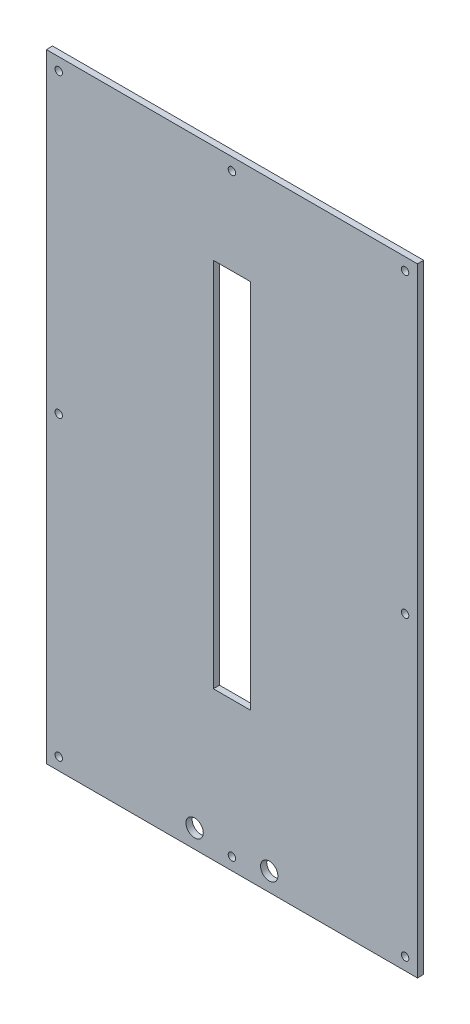
ISO-10303-21;
HEADER;
FILE_DESCRIPTION(('STEP AP214'),'2;1');
FILE_NAME('part.step','',(''),(''),'','','');
FILE_SCHEMA(('AUTOMOTIVE_DESIGN { 1 0 10303 214 1 1 1 1 }'));
ENDSEC;
DATA;
#1=APPLICATION_CONTEXT('core data for automotive mechanical design processes');
#2=APPLICATION_PROTOCOL_DEFINITION('international standard','automotive_design',2000,#1);
#3=PRODUCT_CONTEXT('',#1,'mechanical');
#4=PRODUCT('Part','Part','',(#3));
#5=PRODUCT_RELATED_PRODUCT_CATEGORY('part','',(#4));
#6=PRODUCT_DEFINITION_FORMATION('','',#4);
#7=PRODUCT_DEFINITION_CONTEXT('part definition',#1,'design');
#8=PRODUCT_DEFINITION('design','',#6,#7);
#9=PRODUCT_DEFINITION_SHAPE('','',#8);
#10=(LENGTH_UNIT() NAMED_UNIT(*) SI_UNIT(.MILLI.,.METRE.));
#11=(NAMED_UNIT(*) PLANE_ANGLE_UNIT() SI_UNIT($,.RADIAN.));
#12=(NAMED_UNIT(*) SI_UNIT($,.STERADIAN.) SOLID_ANGLE_UNIT());
#13=UNCERTAINTY_MEASURE_WITH_UNIT(LENGTH_MEASURE(1.E-05),#10,'distance_accuracy_value','');
#14=(GEOMETRIC_REPRESENTATION_CONTEXT(3) GLOBAL_UNCERTAINTY_ASSIGNED_CONTEXT((#13)) GLOBAL_UNIT_ASSIGNED_CONTEXT((#10,
#11,#12)) REPRESENTATION_CONTEXT('',''));
#15=CARTESIAN_POINT('',(0.,0.,0.));
#16=DIRECTION('',(0.,0.,1.));
#17=DIRECTION('',(1.,0.,0.));
#18=AXIS2_PLACEMENT_3D('',#15,#16,#17);
#19=CARTESIAN_POINT('',(0.,0.,5.));
#20=DIRECTION('',(0.,0.,-1.));
#21=DIRECTION('',(-1.,0.,0.));
#22=AXIS2_PLACEMENT_3D('',#19,#20,#21);
#23=PLANE('',#22);
#24=CARTESIAN_POINT('',(0.,-315.,5.));
#25=DIRECTION('',(0.,0.,1.));
#26=DIRECTION('',(1.,0.,0.));
#27=AXIS2_PLACEMENT_3D('',#24,#25,#26);
#28=CIRCLE('',#27,3.);
#29=CARTESIAN_POINT('',(3.00000000000006,-315.,5.));
#30=VERTEX_POINT('',#29);
#31=EDGE_CURVE('E138',#30,#30,#28,.T.);
#32=ORIENTED_EDGE('',*,*,#31,.F.);
#33=EDGE_LOOP('',(#32));
#34=FACE_BOUND('',#33,.T.);
#35=CARTESIAN_POINT('',(0.,165.,5.));
#36=DIRECTION('',(0.,0.,1.));
#37=DIRECTION('',(1.,0.,0.));
#38=AXIS2_PLACEMENT_3D('',#35,#36,#37);
#39=CIRCLE('',#38,3.);
#40=CARTESIAN_POINT('',(2.99999999999998,165.,5.));
#41=VERTEX_POINT('',#40);
#42=EDGE_CURVE('E144',#41,#41,#39,.T.);
#43=ORIENTED_EDGE('',*,*,#42,.F.);
#44=EDGE_LOOP('',(#43));
#45=FACE_BOUND('',#44,.T.);
#46=CARTESIAN_POINT('',(140.,165.,5.));
#47=DIRECTION('',(0.,0.,1.));
#48=DIRECTION('',(-1.,0.,0.));
#49=AXIS2_PLACEMENT_3D('',#46,#47,#48);
#50=CIRCLE('',#49,2.99999999999999);
#51=CARTESIAN_POINT('',(137.,165.,5.));
#52=VERTEX_POINT('',#51);
#53=EDGE_CURVE('E150',#52,#52,#50,.T.);
#54=ORIENTED_EDGE('',*,*,#53,.F.);
#55=EDGE_LOOP('',(#54));
#56=FACE_BOUND('',#55,.T.);
#57=CARTESIAN_POINT('',(140.,-75.,5.));
#58=DIRECTION('',(0.,0.,1.));
#59=DIRECTION('',(-1.,0.,0.));
#60=AXIS2_PLACEMENT_3D('',#57,#58,#59);
#61=CIRCLE('',#60,2.99999999999999);
#62=CARTESIAN_POINT('',(137.,-75.,5.));
#63=VERTEX_POINT('',#62);
#64=EDGE_CURVE('E156',#63,#63,#61,.T.);
#65=ORIENTED_EDGE('',*,*,#64,.F.);
#66=EDGE_LOOP('',(#65));
#67=FACE_BOUND('',#66,.T.);
#68=CARTESIAN_POINT('',(140.,-315.,5.));
#69=DIRECTION('',(0.,0.,1.));
#70=DIRECTION('',(-1.,0.,0.));
#71=AXIS2_PLACEMENT_3D('',#68,#69,#70);
#72=CIRCLE('',#71,2.99999999999999);
#73=CARTESIAN_POINT('',(137.,-315.,5.));
#74=VERTEX_POINT('',#73);
#75=EDGE_CURVE('E162',#74,#74,#72,.T.);
#76=ORIENTED_EDGE('',*,*,#75,.F.);
#77=EDGE_LOOP('',(#76));
#78=FACE_BOUND('',#77,.T.);
#79=CARTESIAN_POINT('',(-140.,-75.,5.));
#80=DIRECTION('',(0.,0.,1.));
#81=DIRECTION('',(1.,0.,0.));
#82=AXIS2_PLACEMENT_3D('',#79,#80,#81);
#83=CIRCLE('',#82,2.99999999999999);
#84=CARTESIAN_POINT('',(-137.,-75.,5.));
#85=VERTEX_POINT('',#84);
#86=EDGE_CURVE('E168',#85,#85,#83,.T.);
#87=ORIENTED_EDGE('',*,*,#86,.F.);
#88=EDGE_LOOP('',(#87));
#89=FACE_BOUND('',#88,.T.);
#90=CARTESIAN_POINT('',(-140.,-315.,5.));
#91=DIRECTION('',(0.,0.,1.));
#92=DIRECTION('',(1.,0.,0.));
#93=AXIS2_PLACEMENT_3D('',#90,#91,#92);
#94=CIRCLE('',#93,2.99999999999999);
#95=CARTESIAN_POINT('',(-137.,-315.,5.));
#96=VERTEX_POINT('',#95);
#97=EDGE_CURVE('E174',#96,#96,#94,.T.);
#98=ORIENTED_EDGE('',*,*,#97,.F.);
#99=EDGE_LOOP('',(#98));
#100=FACE_BOUND('',#99,.T.);
#101=CARTESIAN_POINT('',(-140.,165.,5.));
#102=DIRECTION('',(0.,0.,1.));
#103=DIRECTION('',(1.,0.,0.));
#104=AXIS2_PLACEMENT_3D('',#101,#102,#103);
#105=CIRCLE('',#104,2.99999999999999);
#106=CARTESIAN_POINT('',(-137.,165.,5.));
#107=VERTEX_POINT('',#106);
#108=EDGE_CURVE('E180',#107,#107,#105,.T.);
#109=ORIENTED_EDGE('',*,*,#108,.F.);
#110=EDGE_LOOP('',(#109));
#111=FACE_BOUND('',#110,.T.);
#112=DIRECTION('',(0.,1.,0.));
#113=VECTOR('',#112,1.);
#114=CARTESIAN_POINT('',(150.,-325.,5.));
#115=LINE('',#114,#113);
#116=CARTESIAN_POINT('',(150.,-325.,5.));
#117=VERTEX_POINT('',#116);
#118=CARTESIAN_POINT('',(150.,175.,5.));
#119=VERTEX_POINT('',#118);
#120=EDGE_CURVE('E186',#117,#119,#115,.T.);
#121=ORIENTED_EDGE('',*,*,#120,.T.);
#122=DIRECTION('',(-1.,0.,0.));
#123=VECTOR('',#122,1.);
#124=CARTESIAN_POINT('',(-150.,175.,5.));
#125=LINE('',#124,#123);
#126=CARTESIAN_POINT('',(-150.,175.,5.));
#127=VERTEX_POINT('',#126);
#128=EDGE_CURVE('E189',#119,#127,#125,.T.);
#129=ORIENTED_EDGE('',*,*,#128,.T.);
#130=DIRECTION('',(0.,-1.,0.));
#131=VECTOR('',#130,1.);
#132=CARTESIAN_POINT('',(-150.,-325.,5.));
#133=LINE('',#132,#131);
#134=CARTESIAN_POINT('',(-150.,-325.,5.));
#135=VERTEX_POINT('',#134);
#136=EDGE_CURVE('E192',#127,#135,#133,.T.);
#137=ORIENTED_EDGE('',*,*,#136,.T.);
#138=DIRECTION('',(1.,0.,0.));
#139=VECTOR('',#138,1.);
#140=CARTESIAN_POINT('',(-150.,-325.,5.));
#141=LINE('',#140,#139);
#142=EDGE_CURVE('E194',#135,#117,#141,.T.);
#143=ORIENTED_EDGE('',*,*,#142,.T.);
#144=EDGE_LOOP('',(#121,#129,#137,#143));
#145=FACE_BOUND('',#144,.T.);
#146=DIRECTION('',(0.,1.,0.));
#147=VECTOR('',#146,1.);
#148=CARTESIAN_POINT('',(15.,95.,5.));
#149=LINE('',#148,#147);
#150=CARTESIAN_POINT('',(15.0000000000001,-205.,5.));
#151=VERTEX_POINT('',#150);
#152=CARTESIAN_POINT('',(15.,95.,5.));
#153=VERTEX_POINT('',#152);
#154=EDGE_CURVE('E99',#151,#153,#149,.T.);
#155=ORIENTED_EDGE('',*,*,#154,.F.);
#156=DIRECTION('',(1.,0.,0.));
#157=VECTOR('',#156,1.);
#158=CARTESIAN_POINT('',(-14.9999999999999,-205.,5.));
#159=LINE('',#158,#157);
#160=CARTESIAN_POINT('',(-14.9999999999999,-205.,5.));
#161=VERTEX_POINT('',#160);
#162=EDGE_CURVE('E122',#161,#151,#159,.T.);
#163=ORIENTED_EDGE('',*,*,#162,.F.);
#164=DIRECTION('',(0.,-1.,0.));
#165=VECTOR('',#164,1.);
#166=CARTESIAN_POINT('',(-15.,95.,5.));
#167=LINE('',#166,#165);
#168=CARTESIAN_POINT('',(-15.,95.,5.));
#169=VERTEX_POINT('',#168);
#170=EDGE_CURVE('E120',#169,#161,#167,.T.);
#171=ORIENTED_EDGE('',*,*,#170,.F.);
#172=DIRECTION('',(-1.,0.,0.));
#173=VECTOR('',#172,1.);
#174=CARTESIAN_POINT('',(-15.,95.,5.));
#175=LINE('',#174,#173);
#176=EDGE_CURVE('E107',#153,#169,#175,.T.);
#177=ORIENTED_EDGE('',*,*,#176,.F.);
#178=EDGE_LOOP('',(#155,#163,#171,#177));
#179=FACE_BOUND('',#178,.T.);
#180=CARTESIAN_POINT('',(-30.1499999999999,-310.,5.));
#181=DIRECTION('',(0.,0.,1.));
#182=DIRECTION('',(1.,0.,0.));
#183=AXIS2_PLACEMENT_3D('',#180,#181,#182);
#184=CIRCLE('',#183,7.00000000000001);
#185=CARTESIAN_POINT('',(-23.1499999999999,-310.,5.));
#186=VERTEX_POINT('',#185);
#187=EDGE_CURVE('E128',#186,#186,#184,.T.);
#188=ORIENTED_EDGE('',*,*,#187,.F.);
#189=EDGE_LOOP('',(#188));
#190=FACE_BOUND('',#189,.T.);
#191=CARTESIAN_POINT('',(30.1500000000001,-310.,5.));
#192=DIRECTION('',(0.,0.,1.));
#193=DIRECTION('',(1.,0.,0.));
#194=AXIS2_PLACEMENT_3D('',#191,#192,#193);
#195=CIRCLE('',#194,7.00000000000001);
#196=CARTESIAN_POINT('',(37.1500000000001,-310.,5.));
#197=VERTEX_POINT('',#196);
#198=EDGE_CURVE('E316',#197,#197,#195,.T.);
#199=ORIENTED_EDGE('',*,*,#198,.F.);
#200=EDGE_LOOP('',(#199));
#201=FACE_BOUND('',#200,.T.);
#202=ADVANCED_FACE('F34',(#34,#45,#56,#67,#78,#89,#100,#111,#145,#179,#190,#201),#23,.F.);
#203=CARTESIAN_POINT('',(0.,0.,0.));
#204=DIRECTION('',(0.,0.,-1.));
#205=DIRECTION('',(-1.,0.,0.));
#206=AXIS2_PLACEMENT_3D('',#203,#204,#205);
#207=PLANE('',#206);
#208=CARTESIAN_POINT('',(-30.1499999999999,-310.,0.));
#209=DIRECTION('',(0.,0.,1.));
#210=DIRECTION('',(1.,0.,0.));
#211=AXIS2_PLACEMENT_3D('',#208,#209,#210);
#212=CIRCLE('',#211,7.00000000000001);
#213=CARTESIAN_POINT('',(-23.1499999999999,-310.,0.));
#214=VERTEX_POINT('',#213);
#215=EDGE_CURVE('E322',#214,#214,#212,.T.);
#216=ORIENTED_EDGE('',*,*,#215,.T.);
#217=EDGE_LOOP('',(#216));
#218=FACE_BOUND('',#217,.T.);
#219=CARTESIAN_POINT('',(0.,165.,0.));
#220=DIRECTION('',(0.,0.,1.));
#221=DIRECTION('',(1.,0.,0.));
#222=AXIS2_PLACEMENT_3D('',#219,#220,#221);
#223=CIRCLE('',#222,3.);
#224=CARTESIAN_POINT('',(2.99999999999998,165.,0.));
#225=VERTEX_POINT('',#224);
#226=EDGE_CURVE('E141',#225,#225,#223,.T.);
#227=ORIENTED_EDGE('',*,*,#226,.T.);
#228=EDGE_LOOP('',(#227));
#229=FACE_BOUND('',#228,.T.);
#230=CARTESIAN_POINT('',(140.,-75.,0.));
#231=DIRECTION('',(0.,0.,1.));
#232=DIRECTION('',(-1.,0.,0.));
#233=AXIS2_PLACEMENT_3D('',#230,#231,#232);
#234=CIRCLE('',#233,2.99999999999999);
#235=CARTESIAN_POINT('',(137.,-75.,0.));
#236=VERTEX_POINT('',#235);
#237=EDGE_CURVE('E153',#236,#236,#234,.T.);
#238=ORIENTED_EDGE('',*,*,#237,.T.);
#239=EDGE_LOOP('',(#238));
#240=FACE_BOUND('',#239,.T.);
#241=CARTESIAN_POINT('',(-140.,-75.,0.));
#242=DIRECTION('',(0.,0.,1.));
#243=DIRECTION('',(1.,0.,0.));
#244=AXIS2_PLACEMENT_3D('',#241,#242,#243);
#245=CIRCLE('',#244,2.99999999999999);
#246=CARTESIAN_POINT('',(-137.,-75.,0.));
#247=VERTEX_POINT('',#246);
#248=EDGE_CURVE('E165',#247,#247,#245,.T.);
#249=ORIENTED_EDGE('',*,*,#248,.T.);
#250=EDGE_LOOP('',(#249));
#251=FACE_BOUND('',#250,.T.);
#252=CARTESIAN_POINT('',(-140.,165.,0.));
#253=DIRECTION('',(0.,0.,1.));
#254=DIRECTION('',(1.,0.,0.));
#255=AXIS2_PLACEMENT_3D('',#252,#253,#254);
#256=CIRCLE('',#255,2.99999999999999);
#257=CARTESIAN_POINT('',(-137.,165.,0.));
#258=VERTEX_POINT('',#257);
#259=EDGE_CURVE('E177',#258,#258,#256,.T.);
#260=ORIENTED_EDGE('',*,*,#259,.T.);
#261=EDGE_LOOP('',(#260));
#262=FACE_BOUND('',#261,.T.);
#263=DIRECTION('',(0.,1.,0.));
#264=VECTOR('',#263,1.);
#265=CARTESIAN_POINT('',(150.,-325.,0.));
#266=LINE('',#265,#264);
#267=CARTESIAN_POINT('',(150.,-325.,0.));
#268=VERTEX_POINT('',#267);
#269=CARTESIAN_POINT('',(150.,175.,0.));
#270=VERTEX_POINT('',#269);
#271=EDGE_CURVE('E183',#268,#270,#266,.T.);
#272=ORIENTED_EDGE('',*,*,#271,.F.);
#273=DIRECTION('',(1.,0.,0.));
#274=VECTOR('',#273,1.);
#275=CARTESIAN_POINT('',(-150.,-325.,0.));
#276=LINE('',#275,#274);
#277=CARTESIAN_POINT('',(-150.,-325.,0.));
#278=VERTEX_POINT('',#277);
#279=EDGE_CURVE('E190',#278,#268,#276,.T.);
#280=ORIENTED_EDGE('',*,*,#279,.F.);
#281=DIRECTION('',(0.,-1.,0.));
#282=VECTOR('',#281,1.);
#283=CARTESIAN_POINT('',(-150.,-325.,0.));
#284=LINE('',#283,#282);
#285=CARTESIAN_POINT('',(-150.,175.,0.));
#286=VERTEX_POINT('',#285);
#287=EDGE_CURVE('E201',#286,#278,#284,.T.);
#288=ORIENTED_EDGE('',*,*,#287,.F.);
#289=DIRECTION('',(-1.,0.,0.));
#290=VECTOR('',#289,1.);
#291=CARTESIAN_POINT('',(-150.,175.,0.));
#292=LINE('',#291,#290);
#293=EDGE_CURVE('E199',#270,#286,#292,.T.);
#294=ORIENTED_EDGE('',*,*,#293,.F.);
#295=EDGE_LOOP('',(#272,#280,#288,#294));
#296=FACE_BOUND('',#295,.T.);
#297=CARTESIAN_POINT('',(-140.,-315.,0.));
#298=DIRECTION('',(0.,0.,1.));
#299=DIRECTION('',(1.,0.,0.));
#300=AXIS2_PLACEMENT_3D('',#297,#298,#299);
#301=CIRCLE('',#300,2.99999999999999);
#302=CARTESIAN_POINT('',(-137.,-315.,0.));
#303=VERTEX_POINT('',#302);
#304=EDGE_CURVE('E171',#303,#303,#301,.T.);
#305=ORIENTED_EDGE('',*,*,#304,.T.);
#306=EDGE_LOOP('',(#305));
#307=FACE_BOUND('',#306,.T.);
#308=CARTESIAN_POINT('',(140.,-315.,0.));
#309=DIRECTION('',(0.,0.,1.));
#310=DIRECTION('',(-1.,0.,0.));
#311=AXIS2_PLACEMENT_3D('',#308,#309,#310);
#312=CIRCLE('',#311,2.99999999999999);
#313=CARTESIAN_POINT('',(137.,-315.,0.));
#314=VERTEX_POINT('',#313);
#315=EDGE_CURVE('E159',#314,#314,#312,.T.);
#316=ORIENTED_EDGE('',*,*,#315,.T.);
#317=EDGE_LOOP('',(#316));
#318=FACE_BOUND('',#317,.T.);
#319=CARTESIAN_POINT('',(140.,165.,0.));
#320=DIRECTION('',(0.,0.,1.));
#321=DIRECTION('',(-1.,0.,0.));
#322=AXIS2_PLACEMENT_3D('',#319,#320,#321);
#323=CIRCLE('',#322,2.99999999999999);
#324=CARTESIAN_POINT('',(137.,165.,0.));
#325=VERTEX_POINT('',#324);
#326=EDGE_CURVE('E147',#325,#325,#323,.T.);
#327=ORIENTED_EDGE('',*,*,#326,.T.);
#328=EDGE_LOOP('',(#327));
#329=FACE_BOUND('',#328,.T.);
#330=CARTESIAN_POINT('',(0.,-315.,0.));
#331=DIRECTION('',(0.,0.,1.));
#332=DIRECTION('',(1.,0.,0.));
#333=AXIS2_PLACEMENT_3D('',#330,#331,#332);
#334=CIRCLE('',#333,3.);
#335=CARTESIAN_POINT('',(3.00000000000006,-315.,0.));
#336=VERTEX_POINT('',#335);
#337=EDGE_CURVE('E115',#336,#336,#334,.T.);
#338=ORIENTED_EDGE('',*,*,#337,.T.);
#339=EDGE_LOOP('',(#338));
#340=FACE_BOUND('',#339,.T.);
#341=DIRECTION('',(1.,0.,0.));
#342=VECTOR('',#341,1.);
#343=CARTESIAN_POINT('',(-14.9999999999999,-205.,0.));
#344=LINE('',#343,#342);
#345=CARTESIAN_POINT('',(-14.9999999999999,-205.,0.));
#346=VERTEX_POINT('',#345);
#347=CARTESIAN_POINT('',(15.0000000000001,-205.,0.));
#348=VERTEX_POINT('',#347);
#349=EDGE_CURVE('E108',#346,#348,#344,.T.);
#350=ORIENTED_EDGE('',*,*,#349,.T.);
#351=DIRECTION('',(0.,1.,0.));
#352=VECTOR('',#351,1.);
#353=CARTESIAN_POINT('',(15.,95.,0.));
#354=LINE('',#353,#352);
#355=CARTESIAN_POINT('',(15.,95.,0.));
#356=VERTEX_POINT('',#355);
#357=EDGE_CURVE('E57',#348,#356,#354,.T.);
#358=ORIENTED_EDGE('',*,*,#357,.T.);
#359=DIRECTION('',(-1.,0.,0.));
#360=VECTOR('',#359,1.);
#361=CARTESIAN_POINT('',(-15.,95.,0.));
#362=LINE('',#361,#360);
#363=CARTESIAN_POINT('',(-15.,95.,0.));
#364=VERTEX_POINT('',#363);
#365=EDGE_CURVE('E114',#356,#364,#362,.T.);
#366=ORIENTED_EDGE('',*,*,#365,.T.);
#367=DIRECTION('',(0.,-1.,0.));
#368=VECTOR('',#367,1.);
#369=CARTESIAN_POINT('',(-15.,95.,0.));
#370=LINE('',#369,#368);
#371=EDGE_CURVE('E130',#364,#346,#370,.T.);
#372=ORIENTED_EDGE('',*,*,#371,.T.);
#373=EDGE_LOOP('',(#350,#358,#366,#372));
#374=FACE_BOUND('',#373,.T.);
#375=CARTESIAN_POINT('',(30.1500000000001,-310.,0.));
#376=DIRECTION('',(0.,0.,1.));
#377=DIRECTION('',(1.,0.,0.));
#378=AXIS2_PLACEMENT_3D('',#375,#376,#377);
#379=CIRCLE('',#378,7.00000000000001);
#380=CARTESIAN_POINT('',(37.1500000000001,-310.,0.));
#381=VERTEX_POINT('',#380);
#382=EDGE_CURVE('E319',#381,#381,#379,.T.);
#383=ORIENTED_EDGE('',*,*,#382,.T.);
#384=EDGE_LOOP('',(#383));
#385=FACE_BOUND('',#384,.T.);
#386=ADVANCED_FACE('F219',(#218,#229,#240,#251,#262,#296,#307,#318,#329,#340,#374,#385),#207,.T.);
#387=CARTESIAN_POINT('',(150.,-325.,5.));
#388=DIRECTION('',(-1.,0.,0.));
#389=DIRECTION('',(0.,-1.,0.));
#390=AXIS2_PLACEMENT_3D('',#387,#388,#389);
#391=PLANE('',#390);
#392=ORIENTED_EDGE('',*,*,#271,.T.);
#393=DIRECTION('',(0.,0.,-1.));
#394=VECTOR('',#393,1.);
#395=CARTESIAN_POINT('',(150.,175.,5.));
#396=LINE('',#395,#394);
#397=EDGE_CURVE('E11',#119,#270,#396,.T.);
#398=ORIENTED_EDGE('',*,*,#397,.F.);
#399=ORIENTED_EDGE('',*,*,#120,.F.);
#400=DIRECTION('',(0.,0.,-1.));
#401=VECTOR('',#400,1.);
#402=CARTESIAN_POINT('',(150.,-325.,5.));
#403=LINE('',#402,#401);
#404=EDGE_CURVE('E196',#117,#268,#403,.T.);
#405=ORIENTED_EDGE('',*,*,#404,.T.);
#406=EDGE_LOOP('',(#392,#398,#399,#405));
#407=FACE_BOUND('',#406,.T.);
#408=ADVANCED_FACE('F36',(#407),#391,.F.);
#409=CARTESIAN_POINT('',(-150.,175.,5.));
#410=DIRECTION('',(0.,-1.,0.));
#411=DIRECTION('',(0.,0.,-1.));
#412=AXIS2_PLACEMENT_3D('',#409,#410,#411);
#413=PLANE('',#412);
#414=ORIENTED_EDGE('',*,*,#293,.T.);
#415=DIRECTION('',(0.,0.,-1.));
#416=VECTOR('',#415,1.);
#417=CARTESIAN_POINT('',(-150.,175.,5.));
#418=LINE('',#417,#416);
#419=EDGE_CURVE('E42',#127,#286,#418,.T.);
#420=ORIENTED_EDGE('',*,*,#419,.F.);
#421=ORIENTED_EDGE('',*,*,#128,.F.);
#422=ORIENTED_EDGE('',*,*,#397,.T.);
#423=EDGE_LOOP('',(#414,#420,#421,#422));
#424=FACE_BOUND('',#423,.T.);
#425=ADVANCED_FACE('F229',(#424),#413,.F.);
#426=CARTESIAN_POINT('',(-150.,-325.,5.));
#427=DIRECTION('',(1.,0.,0.));
#428=DIRECTION('',(0.,1.,0.));
#429=AXIS2_PLACEMENT_3D('',#426,#427,#428);
#430=PLANE('',#429);
#431=ORIENTED_EDGE('',*,*,#287,.T.);
#432=DIRECTION('',(0.,0.,-1.));
#433=VECTOR('',#432,1.);
#434=CARTESIAN_POINT('',(-150.,-325.,5.));
#435=LINE('',#434,#433);
#436=EDGE_CURVE('E206',#135,#278,#435,.T.);
#437=ORIENTED_EDGE('',*,*,#436,.F.);
#438=ORIENTED_EDGE('',*,*,#136,.F.);
#439=ORIENTED_EDGE('',*,*,#419,.T.);
#440=EDGE_LOOP('',(#431,#437,#438,#439));
#441=FACE_BOUND('',#440,.T.);
#442=ADVANCED_FACE('F213',(#441),#430,.F.);
#443=CARTESIAN_POINT('',(-150.,-325.,5.));
#444=DIRECTION('',(0.,1.,0.));
#445=DIRECTION('',(-1.,0.,0.));
#446=AXIS2_PLACEMENT_3D('',#443,#444,#445);
#447=PLANE('',#446);
#448=ORIENTED_EDGE('',*,*,#279,.T.);
#449=ORIENTED_EDGE('',*,*,#404,.F.);
#450=ORIENTED_EDGE('',*,*,#142,.F.);
#451=ORIENTED_EDGE('',*,*,#436,.T.);
#452=EDGE_LOOP('',(#448,#449,#450,#451));
#453=FACE_BOUND('',#452,.T.);
#454=ADVANCED_FACE('F223',(#453),#447,.F.);
#455=CARTESIAN_POINT('',(-140.,165.,5.));
#456=DIRECTION('',(0.,0.,-1.));
#457=DIRECTION('',(-1.,0.,0.));
#458=AXIS2_PLACEMENT_3D('',#455,#456,#457);
#459=CYLINDRICAL_SURFACE('',#458,2.99999999999999);
#460=ORIENTED_EDGE('',*,*,#108,.T.);
#461=EDGE_LOOP('',(#460));
#462=FACE_BOUND('',#461,.T.);
#463=ORIENTED_EDGE('',*,*,#259,.F.);
#464=EDGE_LOOP('',(#463));
#465=FACE_BOUND('',#464,.T.);
#466=ADVANCED_FACE('F247',(#462,#465),#459,.F.);
#467=CARTESIAN_POINT('',(-140.,-315.,5.));
#468=DIRECTION('',(0.,0.,-1.));
#469=DIRECTION('',(-1.,0.,0.));
#470=AXIS2_PLACEMENT_3D('',#467,#468,#469);
#471=CYLINDRICAL_SURFACE('',#470,2.99999999999999);
#472=ORIENTED_EDGE('',*,*,#97,.T.);
#473=EDGE_LOOP('',(#472));
#474=FACE_BOUND('',#473,.T.);
#475=ORIENTED_EDGE('',*,*,#304,.F.);
#476=EDGE_LOOP('',(#475));
#477=FACE_BOUND('',#476,.T.);
#478=ADVANCED_FACE('F254',(#474,#477),#471,.F.);
#479=CARTESIAN_POINT('',(-140.,-75.,5.));
#480=DIRECTION('',(0.,0.,-1.));
#481=DIRECTION('',(-1.,0.,0.));
#482=AXIS2_PLACEMENT_3D('',#479,#480,#481);
#483=CYLINDRICAL_SURFACE('',#482,2.99999999999999);
#484=ORIENTED_EDGE('',*,*,#86,.T.);
#485=EDGE_LOOP('',(#484));
#486=FACE_BOUND('',#485,.T.);
#487=ORIENTED_EDGE('',*,*,#248,.F.);
#488=EDGE_LOOP('',(#487));
#489=FACE_BOUND('',#488,.T.);
#490=ADVANCED_FACE('F259',(#486,#489),#483,.F.);
#491=CARTESIAN_POINT('',(140.,-315.,5.));
#492=DIRECTION('',(0.,0.,-1.));
#493=DIRECTION('',(-1.,0.,0.));
#494=AXIS2_PLACEMENT_3D('',#491,#492,#493);
#495=CYLINDRICAL_SURFACE('',#494,2.99999999999999);
#496=ORIENTED_EDGE('',*,*,#75,.T.);
#497=EDGE_LOOP('',(#496));
#498=FACE_BOUND('',#497,.T.);
#499=ORIENTED_EDGE('',*,*,#315,.F.);
#500=EDGE_LOOP('',(#499));
#501=FACE_BOUND('',#500,.T.);
#502=ADVANCED_FACE('F269',(#498,#501),#495,.F.);
#503=CARTESIAN_POINT('',(140.,-75.,5.));
#504=DIRECTION('',(0.,0.,-1.));
#505=DIRECTION('',(-1.,0.,0.));
#506=AXIS2_PLACEMENT_3D('',#503,#504,#505);
#507=CYLINDRICAL_SURFACE('',#506,2.99999999999999);
#508=ORIENTED_EDGE('',*,*,#64,.T.);
#509=EDGE_LOOP('',(#508));
#510=FACE_BOUND('',#509,.T.);
#511=ORIENTED_EDGE('',*,*,#237,.F.);
#512=EDGE_LOOP('',(#511));
#513=FACE_BOUND('',#512,.T.);
#514=ADVANCED_FACE('F276',(#510,#513),#507,.F.);
#515=CARTESIAN_POINT('',(140.,165.,5.));
#516=DIRECTION('',(0.,0.,-1.));
#517=DIRECTION('',(-1.,0.,0.));
#518=AXIS2_PLACEMENT_3D('',#515,#516,#517);
#519=CYLINDRICAL_SURFACE('',#518,2.99999999999999);
#520=ORIENTED_EDGE('',*,*,#53,.T.);
#521=EDGE_LOOP('',(#520));
#522=FACE_BOUND('',#521,.T.);
#523=ORIENTED_EDGE('',*,*,#326,.F.);
#524=EDGE_LOOP('',(#523));
#525=FACE_BOUND('',#524,.T.);
#526=ADVANCED_FACE('F280',(#522,#525),#519,.F.);
#527=CARTESIAN_POINT('',(0.,165.,5.));
#528=DIRECTION('',(0.,0.,-1.));
#529=DIRECTION('',(-1.,0.,0.));
#530=AXIS2_PLACEMENT_3D('',#527,#528,#529);
#531=CYLINDRICAL_SURFACE('',#530,3.);
#532=ORIENTED_EDGE('',*,*,#42,.T.);
#533=EDGE_LOOP('',(#532));
#534=FACE_BOUND('',#533,.T.);
#535=ORIENTED_EDGE('',*,*,#226,.F.);
#536=EDGE_LOOP('',(#535));
#537=FACE_BOUND('',#536,.T.);
#538=ADVANCED_FACE('F284',(#534,#537),#531,.F.);
#539=CARTESIAN_POINT('',(0.,-315.,5.));
#540=DIRECTION('',(0.,0.,-1.));
#541=DIRECTION('',(-1.,0.,0.));
#542=AXIS2_PLACEMENT_3D('',#539,#540,#541);
#543=CYLINDRICAL_SURFACE('',#542,3.);
#544=ORIENTED_EDGE('',*,*,#31,.T.);
#545=EDGE_LOOP('',(#544));
#546=FACE_BOUND('',#545,.T.);
#547=ORIENTED_EDGE('',*,*,#337,.F.);
#548=EDGE_LOOP('',(#547));
#549=FACE_BOUND('',#548,.T.);
#550=ADVANCED_FACE('F288',(#546,#549),#543,.F.);
#551=CARTESIAN_POINT('',(15.,95.,5.));
#552=DIRECTION('',(-1.,0.,0.));
#553=DIRECTION('',(0.,-1.,0.));
#554=AXIS2_PLACEMENT_3D('',#551,#552,#553);
#555=PLANE('',#554);
#556=ORIENTED_EDGE('',*,*,#357,.F.);
#557=DIRECTION('',(0.,0.,-1.));
#558=VECTOR('',#557,1.);
#559=CARTESIAN_POINT('',(15.0000000000001,-205.,5.));
#560=LINE('',#559,#558);
#561=EDGE_CURVE('E103',#151,#348,#560,.T.);
#562=ORIENTED_EDGE('',*,*,#561,.F.);
#563=ORIENTED_EDGE('',*,*,#154,.T.);
#564=DIRECTION('',(0.,0.,-1.));
#565=VECTOR('',#564,1.);
#566=CARTESIAN_POINT('',(15.,95.,5.));
#567=LINE('',#566,#565);
#568=EDGE_CURVE('E102',#153,#356,#567,.T.);
#569=ORIENTED_EDGE('',*,*,#568,.T.);
#570=EDGE_LOOP('',(#556,#562,#563,#569));
#571=FACE_BOUND('',#570,.T.);
#572=ADVANCED_FACE('F101',(#571),#555,.T.);
#573=CARTESIAN_POINT('',(-15.,95.,5.));
#574=DIRECTION('',(0.,-1.,0.));
#575=DIRECTION('',(0.,0.,-1.));
#576=AXIS2_PLACEMENT_3D('',#573,#574,#575);
#577=PLANE('',#576);
#578=ORIENTED_EDGE('',*,*,#365,.F.);
#579=ORIENTED_EDGE('',*,*,#568,.F.);
#580=ORIENTED_EDGE('',*,*,#176,.T.);
#581=DIRECTION('',(0.,0.,-1.));
#582=VECTOR('',#581,1.);
#583=CARTESIAN_POINT('',(-15.,95.,5.));
#584=LINE('',#583,#582);
#585=EDGE_CURVE('E116',#169,#364,#584,.T.);
#586=ORIENTED_EDGE('',*,*,#585,.T.);
#587=EDGE_LOOP('',(#578,#579,#580,#586));
#588=FACE_BOUND('',#587,.T.);
#589=ADVANCED_FACE('F111',(#588),#577,.T.);
#590=CARTESIAN_POINT('',(-15.,95.,5.));
#591=DIRECTION('',(1.,0.,0.));
#592=DIRECTION('',(0.,1.,0.));
#593=AXIS2_PLACEMENT_3D('',#590,#591,#592);
#594=PLANE('',#593);
#595=ORIENTED_EDGE('',*,*,#371,.F.);
#596=ORIENTED_EDGE('',*,*,#585,.F.);
#597=ORIENTED_EDGE('',*,*,#170,.T.);
#598=DIRECTION('',(0.,0.,-1.));
#599=VECTOR('',#598,1.);
#600=CARTESIAN_POINT('',(-14.9999999999999,-205.,5.));
#601=LINE('',#600,#599);
#602=EDGE_CURVE('E49',#161,#346,#601,.T.);
#603=ORIENTED_EDGE('',*,*,#602,.T.);
#604=EDGE_LOOP('',(#595,#596,#597,#603));
#605=FACE_BOUND('',#604,.T.);
#606=ADVANCED_FACE('F297',(#605),#594,.T.);
#607=CARTESIAN_POINT('',(-14.9999999999999,-205.,5.));
#608=DIRECTION('',(0.,1.,0.));
#609=DIRECTION('',(0.,0.,1.));
#610=AXIS2_PLACEMENT_3D('',#607,#608,#609);
#611=PLANE('',#610);
#612=ORIENTED_EDGE('',*,*,#349,.F.);
#613=ORIENTED_EDGE('',*,*,#602,.F.);
#614=ORIENTED_EDGE('',*,*,#162,.T.);
#615=ORIENTED_EDGE('',*,*,#561,.T.);
#616=EDGE_LOOP('',(#612,#613,#614,#615));
#617=FACE_BOUND('',#616,.T.);
#618=ADVANCED_FACE('F300',(#617),#611,.T.);
#619=CARTESIAN_POINT('',(-30.1499999999999,-310.,5.));
#620=DIRECTION('',(0.,0.,-1.));
#621=DIRECTION('',(-1.,0.,0.));
#622=AXIS2_PLACEMENT_3D('',#619,#620,#621);
#623=CYLINDRICAL_SURFACE('',#622,7.00000000000001);
#624=ORIENTED_EDGE('',*,*,#187,.T.);
#625=EDGE_LOOP('',(#624));
#626=FACE_BOUND('',#625,.T.);
#627=ORIENTED_EDGE('',*,*,#215,.F.);
#628=EDGE_LOOP('',(#627));
#629=FACE_BOUND('',#628,.T.);
#630=ADVANCED_FACE('F304',(#626,#629),#623,.F.);
#631=CARTESIAN_POINT('',(30.1500000000001,-310.,5.));
#632=DIRECTION('',(0.,0.,-1.));
#633=DIRECTION('',(-1.,0.,0.));
#634=AXIS2_PLACEMENT_3D('',#631,#632,#633);
#635=CYLINDRICAL_SURFACE('',#634,7.00000000000001);
#636=ORIENTED_EDGE('',*,*,#198,.T.);
#637=EDGE_LOOP('',(#636));
#638=FACE_BOUND('',#637,.T.);
#639=ORIENTED_EDGE('',*,*,#382,.F.);
#640=EDGE_LOOP('',(#639));
#641=FACE_BOUND('',#640,.T.);
#642=ADVANCED_FACE('F307',(#638,#641),#635,.F.);
#643=CLOSED_SHELL('',(#202,#386,#408,#425,#442,#454,#466,#478,#490,#502,#514,#526,#538,#550,
#572,#589,#606,#618,#630,#642));
#644=MANIFOLD_SOLID_BREP('B2',#643);
#645=ADVANCED_BREP_SHAPE_REPRESENTATION('',(#18,#644),#14);
#646=SHAPE_DEFINITION_REPRESENTATION(#9,#645);
ENDSEC;
END-ISO-10303-21;
